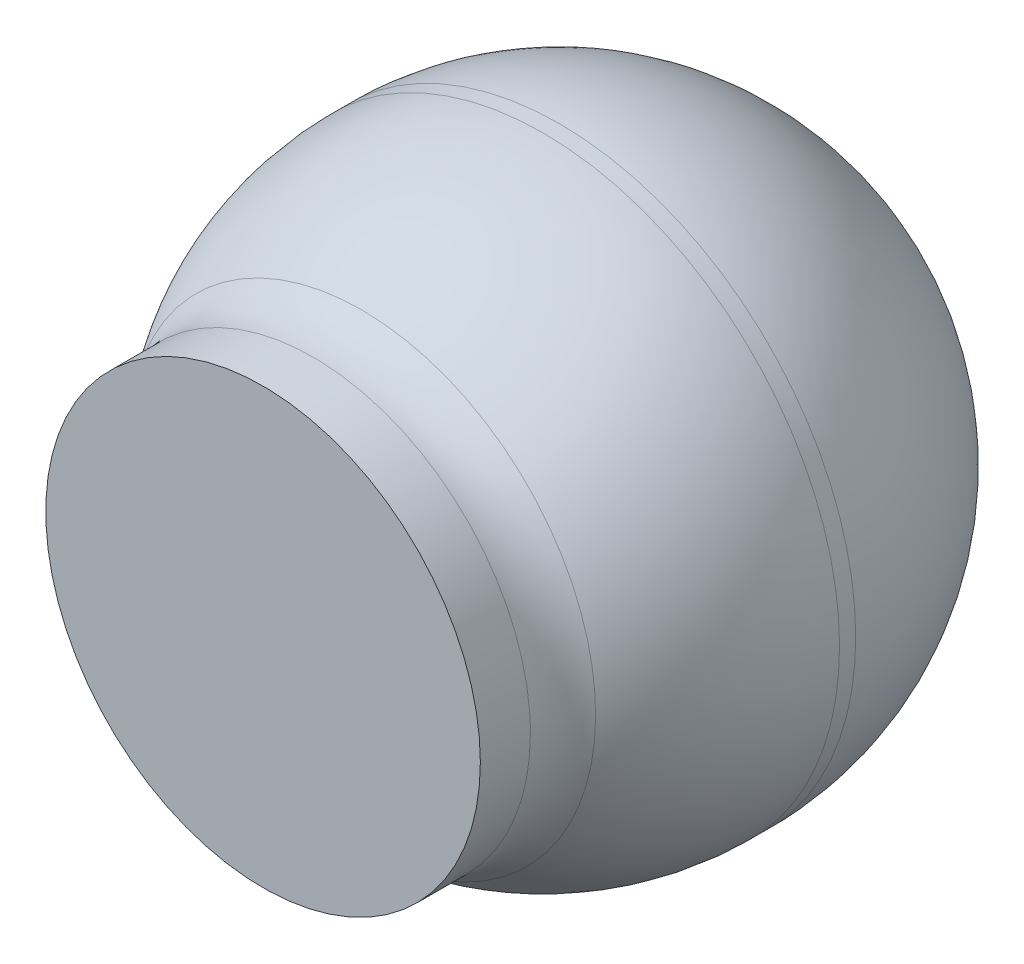
ISO-10303-21;
HEADER;
FILE_DESCRIPTION(('STEP AP214'),'2;1');
FILE_NAME('part.step','',(''),(''),'','','');
FILE_SCHEMA(('AUTOMOTIVE_DESIGN { 1 0 10303 214 1 1 1 1 }'));
ENDSEC;
DATA;
#1=APPLICATION_CONTEXT('core data for automotive mechanical design processes');
#2=APPLICATION_PROTOCOL_DEFINITION('international standard','automotive_design',2000,#1);
#3=PRODUCT_CONTEXT('',#1,'mechanical');
#4=PRODUCT('Part','Part','',(#3));
#5=PRODUCT_RELATED_PRODUCT_CATEGORY('part','',(#4));
#6=PRODUCT_DEFINITION_FORMATION('','',#4);
#7=PRODUCT_DEFINITION_CONTEXT('part definition',#1,'design');
#8=PRODUCT_DEFINITION('design','',#6,#7);
#9=PRODUCT_DEFINITION_SHAPE('','',#8);
#10=(LENGTH_UNIT() NAMED_UNIT(*) SI_UNIT(.MILLI.,.METRE.));
#11=(NAMED_UNIT(*) PLANE_ANGLE_UNIT() SI_UNIT($,.RADIAN.));
#12=(NAMED_UNIT(*) SI_UNIT($,.STERADIAN.) SOLID_ANGLE_UNIT());
#13=UNCERTAINTY_MEASURE_WITH_UNIT(LENGTH_MEASURE(1.E-05),#10,'distance_accuracy_value','');
#14=(GEOMETRIC_REPRESENTATION_CONTEXT(3) GLOBAL_UNCERTAINTY_ASSIGNED_CONTEXT((#13)) GLOBAL_UNIT_ASSIGNED_CONTEXT((#10,
#11,#12)) REPRESENTATION_CONTEXT('',''));
#15=CARTESIAN_POINT('',(0.,0.,0.));
#16=DIRECTION('',(0.,0.,1.));
#17=DIRECTION('',(1.,0.,0.));
#18=AXIS2_PLACEMENT_3D('',#15,#16,#17);
#19=CARTESIAN_POINT('',(-8.182919922269,-5.321349291452,10.006534503384));
#20=DIRECTION('',(0.,0.,-1.));
#21=DIRECTION('',(-1.,0.,0.));
#22=AXIS2_PLACEMENT_3D('',#19,#20,#21);
#23=PLANE('',#22);
#24=CARTESIAN_POINT('',(-8.182919922269,-5.321349291452,10.006534503384));
#25=DIRECTION('',(0.,0.,1.));
#26=DIRECTION('',(1.,0.,0.));
#27=AXIS2_PLACEMENT_3D('',#24,#25,#26);
#28=CIRCLE('',#27,0.275);
#29=CARTESIAN_POINT('',(-7.907919922269,-5.321349291452,10.006534503384));
#30=VERTEX_POINT('',#29);
#31=EDGE_CURVE('E20',#30,#30,#28,.F.);
#32=ORIENTED_EDGE('',*,*,#31,.F.);
#33=EDGE_LOOP('',(#32));
#34=FACE_BOUND('',#33,.T.);
#35=ADVANCED_FACE('F17',(#34),#23,.F.);
#36=CARTESIAN_POINT('',(-8.182919922269,-5.321349291452,9.906534503384));
#37=DIRECTION('',(0.,0.,1.));
#38=DIRECTION('',(1.,0.,0.));
#39=AXIS2_PLACEMENT_3D('',#36,#37,#38);
#40=CYLINDRICAL_SURFACE('',#39,0.275);
#41=CARTESIAN_POINT('',(-8.182919922269,-5.321349291452,9.943180457728));
#42=DIRECTION('',(0.,0.,-1.));
#43=DIRECTION('',(0.996700902337583,0.0811622527992436,0.));
#44=AXIS2_PLACEMENT_3D('',#41,#42,#43);
#45=CIRCLE('',#44,0.275000000000001);
#46=CARTESIAN_POINT('',(-7.90882717412616,-5.29902967193221,9.943180457728));
#47=VERTEX_POINT('',#46);
#48=EDGE_CURVE('E65',#47,#47,#45,.F.);
#49=ORIENTED_EDGE('',*,*,#48,.T.);
#50=EDGE_LOOP('',(#49));
#51=FACE_BOUND('',#50,.T.);
#52=ORIENTED_EDGE('',*,*,#31,.T.);
#53=EDGE_LOOP('',(#52));
#54=FACE_BOUND('',#53,.T.);
#55=ADVANCED_FACE('F62',(#51,#54),#40,.T.);
#56=CARTESIAN_POINT('',(-8.182919922269,-5.321349291452,9.943180457728));
#57=DIRECTION('',(0.,0.,-1.));
#58=DIRECTION('',(0.996700902337583,0.0811622527992448,0.));
#59=AXIS2_PLACEMENT_3D('',#56,#57,#58);
#60=TOROIDAL_SURFACE('',#59,0.375,0.1);
#61=ORIENTED_EDGE('',*,*,#48,.F.);
#62=EDGE_LOOP('',(#61));
#63=FACE_BOUND('',#62,.T.);
#64=CARTESIAN_POINT('',(-8.182919922269,-5.321349291452,9.881744931236));
#65=DIRECTION('',(0.,0.,-1.));
#66=DIRECTION('',(-0.996700902337597,-0.0811622527990627,0.));
#67=AXIS2_PLACEMENT_3D('',#64,#65,#66);
#68=CIRCLE('',#67,0.296097046412663);
#69=CARTESIAN_POINT('',(-8.478040115608,-5.345381194786,9.881744931236));
#70=VERTEX_POINT('',#69);
#71=EDGE_CURVE('E39',#70,#70,#68,.T.);
#72=ORIENTED_EDGE('',*,*,#71,.F.);
#73=EDGE_LOOP('',(#72));
#74=FACE_BOUND('',#73,.T.);
#75=ADVANCED_FACE('F57',(#63,#74),#60,.F.);
#76=CARTESIAN_POINT('',(-8.556682760645,-5.351785136252,9.651976062157));
#77=CARTESIAN_POINT('',(-8.556682760645,-5.351785136252,9.701461392103));
#78=CARTESIAN_POINT('',(-8.548526217348,-5.351120941579,9.750947004335));
#79=CARTESIAN_POINT('',(-8.532207085349,-5.349792059952,9.798626332798));
#80=CARTESIAN_POINT('',(-8.508341390838,-5.347848654938,9.842699544317));
#81=CARTESIAN_POINT('',(-8.478040115608,-5.345381194786,9.881744931236));
#82=(BOUNDED_CURVE() B_SPLINE_CURVE(5,(#76,#77,#78,#79,#80,#81),.UNSPECIFIED.,.F.,
.F.) B_SPLINE_CURVE_WITH_KNOTS((6,6),(0.,0.661568582165),
.UNSPECIFIED.) CURVE() GEOMETRIC_REPRESENTATION_ITEM() RATIONAL_B_SPLINE_CURVE((1.,1.,1.,1.,1.,1.)) REPRESENTATION_ITEM(''));
#83=CARTESIAN_POINT('',(-8.182919922269,-5.321349291452,9.651976062157));
#84=DIRECTION('',(0.,0.,-1.));
#85=AXIS1_PLACEMENT('',#83,#84);
#86=SURFACE_OF_REVOLUTION('',#82,#85);
#87=CARTESIAN_POINT('',(-8.182919922269,-5.321349291452,9.651976062157));
#88=DIRECTION('',(0.,0.,1.));
#89=DIRECTION('',(1.,0.,0.));
#90=AXIS2_PLACEMENT_3D('',#87,#88,#89);
#91=CIRCLE('',#90,0.375);
#92=CARTESIAN_POINT('',(-7.807919922269,-5.321349291452,9.651976062157));
#93=VERTEX_POINT('',#92);
#94=EDGE_CURVE('E36',#93,#93,#91,.F.);
#95=ORIENTED_EDGE('',*,*,#94,.F.);
#96=EDGE_LOOP('',(#95));
#97=FACE_BOUND('',#96,.T.);
#98=ORIENTED_EDGE('',*,*,#71,.T.);
#99=EDGE_LOOP('',(#98));
#100=FACE_BOUND('',#99,.T.);
#101=ADVANCED_FACE('F53',(#97,#100),#86,.F.);
#102=CARTESIAN_POINT('',(-8.182919922269,-5.321349291452,9.256534503384));
#103=DIRECTION('',(0.,0.,1.));
#104=DIRECTION('',(1.,0.,0.));
#105=AXIS2_PLACEMENT_3D('',#102,#103,#104);
#106=CYLINDRICAL_SURFACE('',#105,0.375);
#107=CARTESIAN_POINT('',(-8.182919922269,-5.321349291452,9.631534503384));
#108=DIRECTION('',(0.,0.,-1.));
#109=DIRECTION('',(0.0811622527992357,-0.996700902337583,0.));
#110=AXIS2_PLACEMENT_3D('',#107,#108,#109);
#111=CIRCLE('',#110,0.375);
#112=CARTESIAN_POINT('',(-8.15248407746929,-5.69511212982859,9.631534503384));
#113=VERTEX_POINT('',#112);
#114=CARTESIAN_POINT('',(-8.21335576706871,-4.94758645307541,9.631534503384));
#115=VERTEX_POINT('',#114);
#116=EDGE_CURVE('E11',#113,#115,#111,.T.);
#117=ORIENTED_EDGE('',*,*,#116,.F.);
#118=CARTESIAN_POINT('',(-8.182919922269,-5.321349291452,9.631534503384));
#119=DIRECTION('',(0.,0.,1.));
#120=DIRECTION('',(0.0811622527992365,-0.996700902337583,0.));
#121=AXIS2_PLACEMENT_3D('',#118,#119,#120);
#122=CIRCLE('',#121,0.375);
#123=EDGE_CURVE('E25',#115,#113,#122,.F.);
#124=ORIENTED_EDGE('',*,*,#123,.F.);
#125=EDGE_LOOP('',(#117,#124));
#126=FACE_BOUND('',#125,.T.);
#127=ORIENTED_EDGE('',*,*,#94,.T.);
#128=EDGE_LOOP('',(#127));
#129=FACE_BOUND('',#128,.T.);
#130=ADVANCED_FACE('F34',(#126,#129),#106,.T.);
#131=CARTESIAN_POINT('',(-8.182919922269,-5.321349291452,9.631534503384));
#132=DIRECTION('',(0.0811622527992361,-0.996700902337583,0.));
#133=DIRECTION('',(-0.996700902337583,-0.0811622527992361,0.));
#134=AXIS2_PLACEMENT_3D('',#131,#132,#133);
#135=SPHERICAL_SURFACE('',#134,0.375);
#136=ORIENTED_EDGE('',*,*,#123,.T.);
#137=ORIENTED_EDGE('',*,*,#116,.T.);
#138=EDGE_LOOP('',(#136,#137));
#139=FACE_BOUND('',#138,.T.);
#140=ADVANCED_FACE('F32',(#139),#135,.T.);
#141=CLOSED_SHELL('',(#35,#55,#75,#101,#130,#140));
#142=MANIFOLD_SOLID_BREP('B1',#141);
#143=ADVANCED_BREP_SHAPE_REPRESENTATION('',(#18,#142),#14);
#144=SHAPE_DEFINITION_REPRESENTATION(#9,#143);
ENDSEC;
END-ISO-10303-21;
